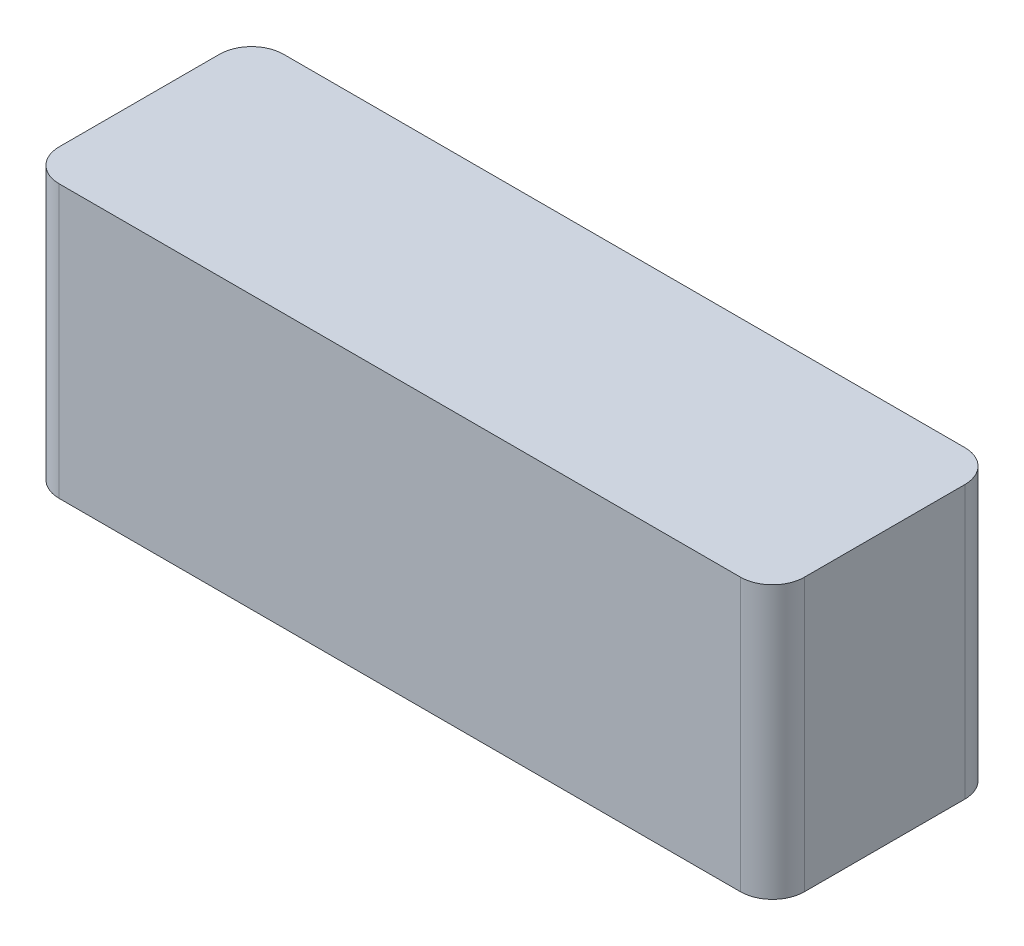
ISO-10303-21;
HEADER;
FILE_DESCRIPTION(('STEP AP214'),'2;1');
FILE_NAME('part.step','',(''),(''),'','','');
FILE_SCHEMA(('AUTOMOTIVE_DESIGN { 1 0 10303 214 1 1 1 1 }'));
ENDSEC;
DATA;
#1=APPLICATION_CONTEXT('core data for automotive mechanical design processes');
#2=APPLICATION_PROTOCOL_DEFINITION('international standard','automotive_design',2000,#1);
#3=PRODUCT_CONTEXT('',#1,'mechanical');
#4=PRODUCT('Part','Part','',(#3));
#5=PRODUCT_RELATED_PRODUCT_CATEGORY('part','',(#4));
#6=PRODUCT_DEFINITION_FORMATION('','',#4);
#7=PRODUCT_DEFINITION_CONTEXT('part definition',#1,'design');
#8=PRODUCT_DEFINITION('design','',#6,#7);
#9=PRODUCT_DEFINITION_SHAPE('','',#8);
#10=(LENGTH_UNIT() NAMED_UNIT(*) SI_UNIT(.MILLI.,.METRE.));
#11=(NAMED_UNIT(*) PLANE_ANGLE_UNIT() SI_UNIT($,.RADIAN.));
#12=(NAMED_UNIT(*) SI_UNIT($,.STERADIAN.) SOLID_ANGLE_UNIT());
#13=UNCERTAINTY_MEASURE_WITH_UNIT(LENGTH_MEASURE(1.E-05),#10,'distance_accuracy_value','');
#14=(GEOMETRIC_REPRESENTATION_CONTEXT(3) GLOBAL_UNCERTAINTY_ASSIGNED_CONTEXT((#13)) GLOBAL_UNIT_ASSIGNED_CONTEXT((#10,
#11,#12)) REPRESENTATION_CONTEXT('',''));
#15=CARTESIAN_POINT('',(0.,0.,0.));
#16=DIRECTION('',(0.,0.,1.));
#17=DIRECTION('',(1.,0.,0.));
#18=AXIS2_PLACEMENT_3D('',#15,#16,#17);
#19=CARTESIAN_POINT('',(-93.,34.,56.));
#20=DIRECTION('',(1.,0.,0.));
#21=DIRECTION('',(0.,0.,-1.));
#22=AXIS2_PLACEMENT_3D('',#19,#20,#21);
#23=PLANE('',#22);
#24=DIRECTION('',(0.,0.,-1.));
#25=VECTOR('',#24,1.);
#26=CARTESIAN_POINT('',(-93.,34.,56.));
#27=LINE('',#26,#25);
#28=CARTESIAN_POINT('',(-93.,34.,48.));
#29=VERTEX_POINT('',#28);
#30=CARTESIAN_POINT('',(-93.,34.,8.));
#31=VERTEX_POINT('',#30);
#32=EDGE_CURVE('E164',#29,#31,#27,.T.);
#33=ORIENTED_EDGE('',*,*,#32,.T.);
#34=DIRECTION('',(0.,-1.,0.));
#35=VECTOR('',#34,1.);
#36=CARTESIAN_POINT('',(-93.,34.,8.));
#37=LINE('',#36,#35);
#38=CARTESIAN_POINT('',(-93.,-34.,8.));
#39=VERTEX_POINT('',#38);
#40=EDGE_CURVE('E120',#31,#39,#37,.T.);
#41=ORIENTED_EDGE('',*,*,#40,.T.);
#42=DIRECTION('',(0.,0.,-1.));
#43=VECTOR('',#42,1.);
#44=CARTESIAN_POINT('',(-93.,-34.,56.));
#45=LINE('',#44,#43);
#46=CARTESIAN_POINT('',(-93.,-34.,48.));
#47=VERTEX_POINT('',#46);
#48=EDGE_CURVE('E104',#47,#39,#45,.T.);
#49=ORIENTED_EDGE('',*,*,#48,.F.);
#50=DIRECTION('',(0.,-1.,0.));
#51=VECTOR('',#50,1.);
#52=CARTESIAN_POINT('',(-93.,34.,48.));
#53=LINE('',#52,#51);
#54=EDGE_CURVE('E117',#47,#29,#53,.F.);
#55=ORIENTED_EDGE('',*,*,#54,.T.);
#56=EDGE_LOOP('',(#33,#41,#49,#55));
#57=FACE_BOUND('',#56,.T.);
#58=ADVANCED_FACE('F35',(#57),#23,.F.);
#59=CARTESIAN_POINT('',(-93.,-34.,56.));
#60=DIRECTION('',(0.,1.,0.));
#61=DIRECTION('',(0.,0.,1.));
#62=AXIS2_PLACEMENT_3D('',#59,#60,#61);
#63=PLANE('',#62);
#64=ORIENTED_EDGE('',*,*,#48,.T.);
#65=CARTESIAN_POINT('',(-85.,-34.,8.));
#66=DIRECTION('',(0.,1.,0.));
#67=DIRECTION('',(0.,0.,1.));
#68=AXIS2_PLACEMENT_3D('',#65,#66,#67);
#69=CIRCLE('',#68,8.);
#70=CARTESIAN_POINT('',(-85.,-34.,0.));
#71=VERTEX_POINT('',#70);
#72=EDGE_CURVE('E111',#39,#71,#69,.F.);
#73=ORIENTED_EDGE('',*,*,#72,.T.);
#74=DIRECTION('',(1.,0.,0.));
#75=VECTOR('',#74,1.);
#76=CARTESIAN_POINT('',(-93.,-34.,0.));
#77=LINE('',#76,#75);
#78=CARTESIAN_POINT('',(84.9999999999999,-34.,0.));
#79=VERTEX_POINT('',#78);
#80=EDGE_CURVE('E170',#71,#79,#77,.T.);
#81=ORIENTED_EDGE('',*,*,#80,.T.);
#82=CARTESIAN_POINT('',(85.,-34.,8.));
#83=DIRECTION('',(0.,1.,0.));
#84=DIRECTION('',(0.,0.,1.));
#85=AXIS2_PLACEMENT_3D('',#82,#83,#84);
#86=CIRCLE('',#85,8.);
#87=CARTESIAN_POINT('',(93.,-34.,8.));
#88=VERTEX_POINT('',#87);
#89=EDGE_CURVE('E112',#79,#88,#86,.F.);
#90=ORIENTED_EDGE('',*,*,#89,.T.);
#91=DIRECTION('',(0.,0.,-1.));
#92=VECTOR('',#91,1.);
#93=CARTESIAN_POINT('',(93.,-34.,56.));
#94=LINE('',#93,#92);
#95=CARTESIAN_POINT('',(93.,-34.,48.));
#96=VERTEX_POINT('',#95);
#97=EDGE_CURVE('E121',#96,#88,#94,.T.);
#98=ORIENTED_EDGE('',*,*,#97,.F.);
#99=CARTESIAN_POINT('',(85.,-34.,48.));
#100=DIRECTION('',(0.,1.,0.));
#101=DIRECTION('',(0.,0.,1.));
#102=AXIS2_PLACEMENT_3D('',#99,#100,#101);
#103=CIRCLE('',#102,8.);
#104=CARTESIAN_POINT('',(84.9999999999999,-34.,56.));
#105=VERTEX_POINT('',#104);
#106=EDGE_CURVE('E127',#96,#105,#103,.F.);
#107=ORIENTED_EDGE('',*,*,#106,.T.);
#108=DIRECTION('',(1.,0.,0.));
#109=VECTOR('',#108,1.);
#110=CARTESIAN_POINT('',(-93.,-34.,56.));
#111=LINE('',#110,#109);
#112=CARTESIAN_POINT('',(-85.,-34.,56.));
#113=VERTEX_POINT('',#112);
#114=EDGE_CURVE('E106',#113,#105,#111,.T.);
#115=ORIENTED_EDGE('',*,*,#114,.F.);
#116=CARTESIAN_POINT('',(-85.,-34.,48.));
#117=DIRECTION('',(0.,1.,0.));
#118=DIRECTION('',(0.,0.,1.));
#119=AXIS2_PLACEMENT_3D('',#116,#117,#118);
#120=CIRCLE('',#119,8.);
#121=EDGE_CURVE('E101',#113,#47,#120,.F.);
#122=ORIENTED_EDGE('',*,*,#121,.T.);
#123=EDGE_LOOP('',(#64,#73,#81,#90,#98,#107,#115,#122));
#124=FACE_BOUND('',#123,.T.);
#125=ADVANCED_FACE('F103',(#124),#63,.F.);
#126=CARTESIAN_POINT('',(93.,34.,56.));
#127=DIRECTION('',(-1.,0.,0.));
#128=DIRECTION('',(0.,0.,1.));
#129=AXIS2_PLACEMENT_3D('',#126,#127,#128);
#130=PLANE('',#129);
#131=ORIENTED_EDGE('',*,*,#97,.T.);
#132=DIRECTION('',(0.,1.,0.));
#133=VECTOR('',#132,1.);
#134=CARTESIAN_POINT('',(93.,34.,8.));
#135=LINE('',#134,#133);
#136=CARTESIAN_POINT('',(93.,34.,8.));
#137=VERTEX_POINT('',#136);
#138=EDGE_CURVE('E11',#88,#137,#135,.T.);
#139=ORIENTED_EDGE('',*,*,#138,.T.);
#140=DIRECTION('',(0.,0.,-1.));
#141=VECTOR('',#140,1.);
#142=CARTESIAN_POINT('',(93.,34.,56.));
#143=LINE('',#142,#141);
#144=CARTESIAN_POINT('',(93.,34.,48.));
#145=VERTEX_POINT('',#144);
#146=EDGE_CURVE('E152',#145,#137,#143,.T.);
#147=ORIENTED_EDGE('',*,*,#146,.F.);
#148=DIRECTION('',(0.,1.,0.));
#149=VECTOR('',#148,1.);
#150=CARTESIAN_POINT('',(93.,-34.,48.));
#151=LINE('',#150,#149);
#152=EDGE_CURVE('E43',#145,#96,#151,.F.);
#153=ORIENTED_EDGE('',*,*,#152,.T.);
#154=EDGE_LOOP('',(#131,#139,#147,#153));
#155=FACE_BOUND('',#154,.T.);
#156=ADVANCED_FACE('F151',(#155),#130,.F.);
#157=CARTESIAN_POINT('',(-93.,34.,56.));
#158=DIRECTION('',(0.,-1.,0.));
#159=DIRECTION('',(0.,0.,-1.));
#160=AXIS2_PLACEMENT_3D('',#157,#158,#159);
#161=PLANE('',#160);
#162=DIRECTION('',(-1.,0.,0.));
#163=VECTOR('',#162,1.);
#164=CARTESIAN_POINT('',(-93.,34.,0.));
#165=LINE('',#164,#163);
#166=CARTESIAN_POINT('',(84.9999999999999,34.,0.));
#167=VERTEX_POINT('',#166);
#168=CARTESIAN_POINT('',(-85.,34.,0.));
#169=VERTEX_POINT('',#168);
#170=EDGE_CURVE('E167',#167,#169,#165,.T.);
#171=ORIENTED_EDGE('',*,*,#170,.T.);
#172=CARTESIAN_POINT('',(-85.,34.,8.));
#173=DIRECTION('',(0.,-1.,0.));
#174=DIRECTION('',(0.,0.,-1.));
#175=AXIS2_PLACEMENT_3D('',#172,#173,#174);
#176=CIRCLE('',#175,8.);
#177=EDGE_CURVE('E141',#169,#31,#176,.F.);
#178=ORIENTED_EDGE('',*,*,#177,.T.);
#179=ORIENTED_EDGE('',*,*,#32,.F.);
#180=CARTESIAN_POINT('',(-85.,34.,48.));
#181=DIRECTION('',(0.,-1.,0.));
#182=DIRECTION('',(0.,0.,-1.));
#183=AXIS2_PLACEMENT_3D('',#180,#181,#182);
#184=CIRCLE('',#183,8.);
#185=CARTESIAN_POINT('',(-85.,34.,56.));
#186=VERTEX_POINT('',#185);
#187=EDGE_CURVE('E125',#29,#186,#184,.F.);
#188=ORIENTED_EDGE('',*,*,#187,.T.);
#189=DIRECTION('',(-1.,0.,0.));
#190=VECTOR('',#189,1.);
#191=CARTESIAN_POINT('',(-93.,34.,56.));
#192=LINE('',#191,#190);
#193=CARTESIAN_POINT('',(84.9999999999999,34.,56.));
#194=VERTEX_POINT('',#193);
#195=EDGE_CURVE('E161',#194,#186,#192,.T.);
#196=ORIENTED_EDGE('',*,*,#195,.F.);
#197=CARTESIAN_POINT('',(85.,34.,48.));
#198=DIRECTION('',(0.,-1.,0.));
#199=DIRECTION('',(0.,0.,-1.));
#200=AXIS2_PLACEMENT_3D('',#197,#198,#199);
#201=CIRCLE('',#200,8.);
#202=EDGE_CURVE('E57',#194,#145,#201,.F.);
#203=ORIENTED_EDGE('',*,*,#202,.T.);
#204=ORIENTED_EDGE('',*,*,#146,.T.);
#205=CARTESIAN_POINT('',(85.,34.,8.));
#206=DIRECTION('',(0.,-1.,0.));
#207=DIRECTION('',(0.,0.,-1.));
#208=AXIS2_PLACEMENT_3D('',#205,#206,#207);
#209=CIRCLE('',#208,8.);
#210=EDGE_CURVE('E50',#137,#167,#209,.F.);
#211=ORIENTED_EDGE('',*,*,#210,.T.);
#212=EDGE_LOOP('',(#171,#178,#179,#188,#196,#203,#204,#211));
#213=FACE_BOUND('',#212,.T.);
#214=ADVANCED_FACE('F163',(#213),#161,.F.);
#215=CARTESIAN_POINT('',(0.,0.,56.));
#216=DIRECTION('',(0.,0.,1.));
#217=DIRECTION('',(1.,0.,0.));
#218=AXIS2_PLACEMENT_3D('',#215,#216,#217);
#219=PLANE('',#218);
#220=ORIENTED_EDGE('',*,*,#195,.T.);
#221=DIRECTION('',(0.,-1.,0.));
#222=VECTOR('',#221,1.);
#223=CARTESIAN_POINT('',(-85.,-34.,56.));
#224=LINE('',#223,#222);
#225=EDGE_CURVE('E146',#186,#113,#224,.T.);
#226=ORIENTED_EDGE('',*,*,#225,.T.);
#227=ORIENTED_EDGE('',*,*,#114,.T.);
#228=DIRECTION('',(0.,1.,0.));
#229=VECTOR('',#228,1.);
#230=CARTESIAN_POINT('',(85.,34.,56.));
#231=LINE('',#230,#229);
#232=EDGE_CURVE('E143',#105,#194,#231,.T.);
#233=ORIENTED_EDGE('',*,*,#232,.T.);
#234=EDGE_LOOP('',(#220,#226,#227,#233));
#235=FACE_BOUND('',#234,.T.);
#236=ADVANCED_FACE('F160',(#235),#219,.T.);
#237=CARTESIAN_POINT('',(0.,0.,0.));
#238=DIRECTION('',(0.,0.,1.));
#239=DIRECTION('',(1.,0.,0.));
#240=AXIS2_PLACEMENT_3D('',#237,#238,#239);
#241=PLANE('',#240);
#242=ORIENTED_EDGE('',*,*,#80,.F.);
#243=DIRECTION('',(0.,-1.,0.));
#244=VECTOR('',#243,1.);
#245=CARTESIAN_POINT('',(-85.,0.,0.));
#246=LINE('',#245,#244);
#247=EDGE_CURVE('E136',#71,#169,#246,.F.);
#248=ORIENTED_EDGE('',*,*,#247,.T.);
#249=ORIENTED_EDGE('',*,*,#170,.F.);
#250=DIRECTION('',(0.,1.,0.));
#251=VECTOR('',#250,1.);
#252=CARTESIAN_POINT('',(85.,0.,0.));
#253=LINE('',#252,#251);
#254=EDGE_CURVE('E134',#167,#79,#253,.F.);
#255=ORIENTED_EDGE('',*,*,#254,.T.);
#256=EDGE_LOOP('',(#242,#248,#249,#255));
#257=FACE_BOUND('',#256,.T.);
#258=ADVANCED_FACE('F177',(#257),#241,.F.);
#259=CARTESIAN_POINT('',(-85.,34.,8.));
#260=DIRECTION('',(0.,-1.,0.));
#261=DIRECTION('',(0.,0.,-1.));
#262=AXIS2_PLACEMENT_3D('',#259,#260,#261);
#263=CYLINDRICAL_SURFACE('',#262,8.);
#264=ORIENTED_EDGE('',*,*,#177,.F.);
#265=ORIENTED_EDGE('',*,*,#247,.F.);
#266=ORIENTED_EDGE('',*,*,#72,.F.);
#267=ORIENTED_EDGE('',*,*,#40,.F.);
#268=EDGE_LOOP('',(#264,#265,#266,#267));
#269=FACE_BOUND('',#268,.T.);
#270=ADVANCED_FACE('F185',(#269),#263,.T.);
#271=CARTESIAN_POINT('',(-85.,0.,48.));
#272=DIRECTION('',(0.,1.,0.));
#273=DIRECTION('',(0.,0.,1.));
#274=AXIS2_PLACEMENT_3D('',#271,#272,#273);
#275=CYLINDRICAL_SURFACE('',#274,8.);
#276=ORIENTED_EDGE('',*,*,#187,.F.);
#277=ORIENTED_EDGE('',*,*,#54,.F.);
#278=ORIENTED_EDGE('',*,*,#121,.F.);
#279=ORIENTED_EDGE('',*,*,#225,.F.);
#280=EDGE_LOOP('',(#276,#277,#278,#279));
#281=FACE_BOUND('',#280,.T.);
#282=ADVANCED_FACE('F124',(#281),#275,.T.);
#283=CARTESIAN_POINT('',(85.,34.,8.));
#284=DIRECTION('',(0.,1.,0.));
#285=DIRECTION('',(0.,0.,1.));
#286=AXIS2_PLACEMENT_3D('',#283,#284,#285);
#287=CYLINDRICAL_SURFACE('',#286,8.);
#288=ORIENTED_EDGE('',*,*,#89,.F.);
#289=ORIENTED_EDGE('',*,*,#254,.F.);
#290=ORIENTED_EDGE('',*,*,#210,.F.);
#291=ORIENTED_EDGE('',*,*,#138,.F.);
#292=EDGE_LOOP('',(#288,#289,#290,#291));
#293=FACE_BOUND('',#292,.T.);
#294=ADVANCED_FACE('F179',(#293),#287,.T.);
#295=CARTESIAN_POINT('',(85.,0.,48.));
#296=DIRECTION('',(0.,-1.,0.));
#297=DIRECTION('',(0.,0.,-1.));
#298=AXIS2_PLACEMENT_3D('',#295,#296,#297);
#299=CYLINDRICAL_SURFACE('',#298,8.);
#300=ORIENTED_EDGE('',*,*,#106,.F.);
#301=ORIENTED_EDGE('',*,*,#152,.F.);
#302=ORIENTED_EDGE('',*,*,#202,.F.);
#303=ORIENTED_EDGE('',*,*,#232,.F.);
#304=EDGE_LOOP('',(#300,#301,#302,#303));
#305=FACE_BOUND('',#304,.T.);
#306=ADVANCED_FACE('F37',(#305),#299,.T.);
#307=CLOSED_SHELL('',(#58,#125,#156,#214,#236,#258,#270,#282,#294,#306));
#308=MANIFOLD_SOLID_BREP('B2',#307);
#309=ADVANCED_BREP_SHAPE_REPRESENTATION('',(#18,#308),#14);
#310=SHAPE_DEFINITION_REPRESENTATION(#9,#309);
ENDSEC;
END-ISO-10303-21;
